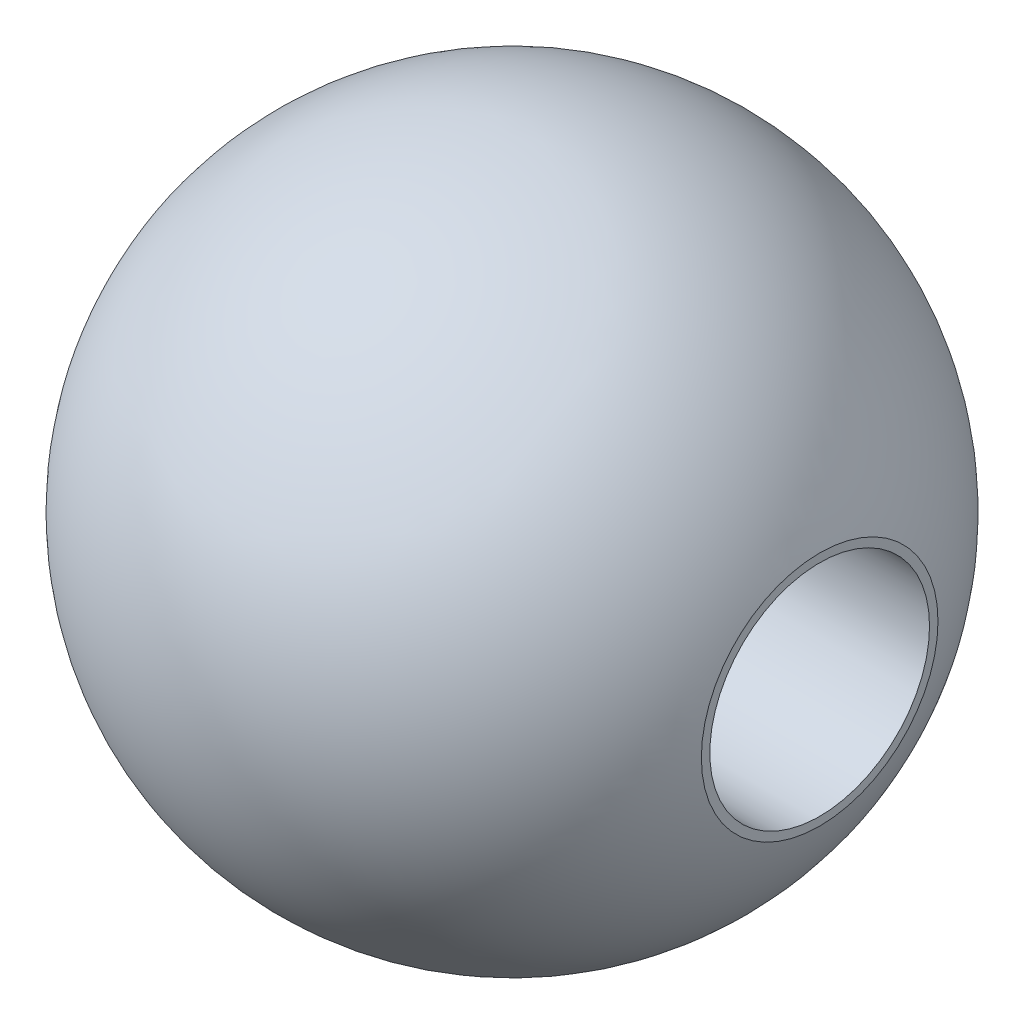
ISO-10303-21;
HEADER;
FILE_DESCRIPTION(('STEP AP214'),'2;1');
FILE_NAME('part.step','',(''),(''),'','','');
FILE_SCHEMA(('AUTOMOTIVE_DESIGN { 1 0 10303 214 1 1 1 1 }'));
ENDSEC;
DATA;
#1=APPLICATION_CONTEXT('core data for automotive mechanical design processes');
#2=APPLICATION_PROTOCOL_DEFINITION('international standard','automotive_design',2000,#1);
#3=PRODUCT_CONTEXT('',#1,'mechanical');
#4=PRODUCT('Part','Part','',(#3));
#5=PRODUCT_RELATED_PRODUCT_CATEGORY('part','',(#4));
#6=PRODUCT_DEFINITION_FORMATION('','',#4);
#7=PRODUCT_DEFINITION_CONTEXT('part definition',#1,'design');
#8=PRODUCT_DEFINITION('design','',#6,#7);
#9=PRODUCT_DEFINITION_SHAPE('','',#8);
#10=(LENGTH_UNIT() NAMED_UNIT(*) SI_UNIT(.MILLI.,.METRE.));
#11=(NAMED_UNIT(*) PLANE_ANGLE_UNIT() SI_UNIT($,.RADIAN.));
#12=(NAMED_UNIT(*) SI_UNIT($,.STERADIAN.) SOLID_ANGLE_UNIT());
#13=UNCERTAINTY_MEASURE_WITH_UNIT(LENGTH_MEASURE(1.E-05),#10,'distance_accuracy_value','');
#14=(GEOMETRIC_REPRESENTATION_CONTEXT(3) GLOBAL_UNCERTAINTY_ASSIGNED_CONTEXT((#13)) GLOBAL_UNIT_ASSIGNED_CONTEXT((#10,
#11,#12)) REPRESENTATION_CONTEXT('',''));
#15=CARTESIAN_POINT('',(0.,0.,0.));
#16=DIRECTION('',(0.,0.,1.));
#17=DIRECTION('',(1.,0.,0.));
#18=AXIS2_PLACEMENT_3D('',#15,#16,#17);
#19=CARTESIAN_POINT('',(14.,0.,0.));
#20=DIRECTION('',(-1.,0.,0.));
#21=DIRECTION('',(0.,0.,1.));
#22=AXIS2_PLACEMENT_3D('',#19,#20,#21);
#23=PLANE('',#22);
#24=CARTESIAN_POINT('',(14.,0.,0.));
#25=DIRECTION('',(1.,0.,0.));
#26=DIRECTION('',(0.,0.,-1.));
#27=AXIS2_PLACEMENT_3D('',#24,#25,#26);
#28=CIRCLE('',#27,5.);
#29=CARTESIAN_POINT('',(14.,0.,-5.));
#30=VERTEX_POINT('',#29);
#31=EDGE_CURVE('E46',#30,#30,#28,.T.);
#32=ORIENTED_EDGE('',*,*,#31,.F.);
#33=EDGE_LOOP('',(#32));
#34=FACE_BOUND('',#33,.T.);
#35=CARTESIAN_POINT('',(14.,0.,0.));
#36=DIRECTION('',(-1.,0.,0.));
#37=DIRECTION('',(0.,0.,1.));
#38=AXIS2_PLACEMENT_3D('',#35,#36,#37);
#39=CIRCLE('',#38,5.3851648071345);
#40=CARTESIAN_POINT('',(14.,0.,5.3851648071345));
#41=VERTEX_POINT('',#40);
#42=EDGE_CURVE('E10',#41,#41,#39,.T.);
#43=ORIENTED_EDGE('',*,*,#42,.F.);
#44=EDGE_LOOP('',(#43));
#45=FACE_BOUND('',#44,.T.);
#46=ADVANCED_FACE('F32',(#34,#45),#23,.F.);
#47=CARTESIAN_POINT('',(0.,0.,0.));
#48=DIRECTION('',(-1.,0.,0.));
#49=DIRECTION('',(0.,0.,-1.));
#50=AXIS2_PLACEMENT_3D('',#47,#48,#49);
#51=SPHERICAL_SURFACE('',#50,15.);
#52=CARTESIAN_POINT('',(-14.,0.,0.));
#53=DIRECTION('',(-1.,0.,0.));
#54=DIRECTION('',(0.,0.,1.));
#55=AXIS2_PLACEMENT_3D('',#52,#53,#54);
#56=CIRCLE('',#55,5.3851648071345);
#57=CARTESIAN_POINT('',(-14.,0.,5.3851648071345));
#58=VERTEX_POINT('',#57);
#59=EDGE_CURVE('E38',#58,#58,#56,.T.);
#60=ORIENTED_EDGE('',*,*,#59,.F.);
#61=EDGE_LOOP('',(#60));
#62=FACE_BOUND('',#61,.T.);
#63=ORIENTED_EDGE('',*,*,#42,.T.);
#64=EDGE_LOOP('',(#63));
#65=FACE_BOUND('',#64,.T.);
#66=ADVANCED_FACE('F56',(#62,#65),#51,.T.);
#67=CARTESIAN_POINT('',(-14.,0.,0.));
#68=DIRECTION('',(1.,0.,0.));
#69=DIRECTION('',(0.,0.,-1.));
#70=AXIS2_PLACEMENT_3D('',#67,#68,#69);
#71=PLANE('',#70);
#72=CARTESIAN_POINT('',(-14.,0.,0.));
#73=DIRECTION('',(1.,0.,0.));
#74=DIRECTION('',(0.,0.,-1.));
#75=AXIS2_PLACEMENT_3D('',#72,#73,#74);
#76=CIRCLE('',#75,5.);
#77=CARTESIAN_POINT('',(-14.,0.,-5.));
#78=VERTEX_POINT('',#77);
#79=EDGE_CURVE('E42',#78,#78,#76,.T.);
#80=ORIENTED_EDGE('',*,*,#79,.T.);
#81=EDGE_LOOP('',(#80));
#82=FACE_BOUND('',#81,.T.);
#83=ORIENTED_EDGE('',*,*,#59,.T.);
#84=EDGE_LOOP('',(#83));
#85=FACE_BOUND('',#84,.T.);
#86=ADVANCED_FACE('F60',(#82,#85),#71,.F.);
#87=CARTESIAN_POINT('',(-14.,0.,0.));
#88=DIRECTION('',(1.,0.,0.));
#89=DIRECTION('',(0.,0.,-1.));
#90=AXIS2_PLACEMENT_3D('',#87,#88,#89);
#91=CYLINDRICAL_SURFACE('',#90,5.);
#92=ORIENTED_EDGE('',*,*,#79,.F.);
#93=EDGE_LOOP('',(#92));
#94=FACE_BOUND('',#93,.T.);
#95=ORIENTED_EDGE('',*,*,#31,.T.);
#96=EDGE_LOOP('',(#95));
#97=FACE_BOUND('',#96,.T.);
#98=ADVANCED_FACE('F52',(#94,#97),#91,.F.);
#99=CLOSED_SHELL('',(#46,#66,#86,#98));
#100=MANIFOLD_SOLID_BREP('B2',#99);
#101=ADVANCED_BREP_SHAPE_REPRESENTATION('',(#18,#100),#14);
#102=SHAPE_DEFINITION_REPRESENTATION(#9,#101);
ENDSEC;
END-ISO-10303-21;
